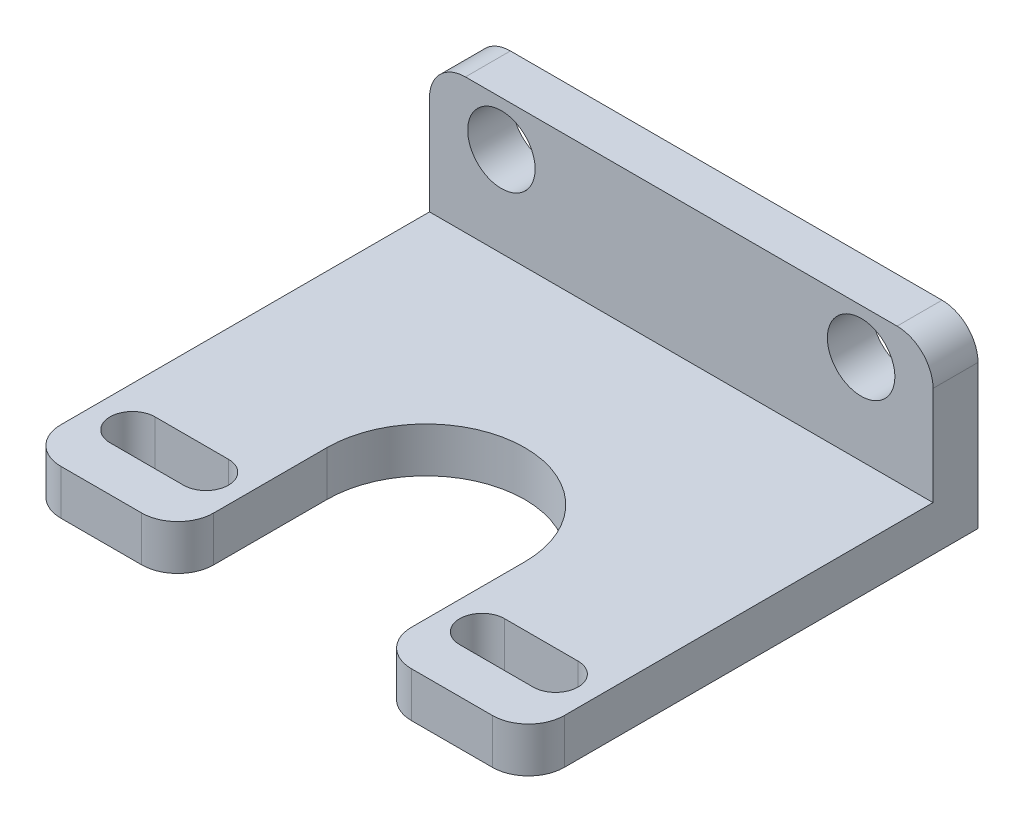
ISO-10303-21;
HEADER;
FILE_DESCRIPTION(('STEP AP214'),'2;1');
FILE_NAME('part.step','',(''),(''),'','','');
FILE_SCHEMA(('AUTOMOTIVE_DESIGN { 1 0 10303 214 1 1 1 1 }'));
ENDSEC;
DATA;
#1=APPLICATION_CONTEXT('core data for automotive mechanical design processes');
#2=APPLICATION_PROTOCOL_DEFINITION('international standard','automotive_design',2000,#1);
#3=PRODUCT_CONTEXT('',#1,'mechanical');
#4=PRODUCT('Part','Part','',(#3));
#5=PRODUCT_RELATED_PRODUCT_CATEGORY('part','',(#4));
#6=PRODUCT_DEFINITION_FORMATION('','',#4);
#7=PRODUCT_DEFINITION_CONTEXT('part definition',#1,'design');
#8=PRODUCT_DEFINITION('design','',#6,#7);
#9=PRODUCT_DEFINITION_SHAPE('','',#8);
#10=(LENGTH_UNIT() NAMED_UNIT(*) SI_UNIT(.MILLI.,.METRE.));
#11=(NAMED_UNIT(*) PLANE_ANGLE_UNIT() SI_UNIT($,.RADIAN.));
#12=(NAMED_UNIT(*) SI_UNIT($,.STERADIAN.) SOLID_ANGLE_UNIT());
#13=UNCERTAINTY_MEASURE_WITH_UNIT(LENGTH_MEASURE(1.E-05),#10,'distance_accuracy_value','');
#14=(GEOMETRIC_REPRESENTATION_CONTEXT(3) GLOBAL_UNCERTAINTY_ASSIGNED_CONTEXT((#13)) GLOBAL_UNIT_ASSIGNED_CONTEXT((#10,
#11,#12)) REPRESENTATION_CONTEXT('',''));
#15=CARTESIAN_POINT('',(0.,0.,0.));
#16=DIRECTION('',(0.,0.,1.));
#17=DIRECTION('',(1.,0.,0.));
#18=AXIS2_PLACEMENT_3D('',#15,#16,#17);
#19=CARTESIAN_POINT('',(0.,0.,31.75));
#20=DIRECTION('',(0.,0.,1.));
#21=DIRECTION('',(1.,0.,0.));
#22=AXIS2_PLACEMENT_3D('',#19,#20,#21);
#23=PLANE('',#22);
#24=DIRECTION('',(1.,0.,0.));
#25=VECTOR('',#24,1.);
#26=CARTESIAN_POINT('',(-17.78,-6.34999999999999,31.75));
#27=LINE('',#26,#25);
#28=CARTESIAN_POINT('',(-15.24,-6.34999999999999,31.75));
#29=VERTEX_POINT('',#28);
#30=CARTESIAN_POINT('',(-9.525,-6.34999999999999,31.75));
#31=VERTEX_POINT('',#30);
#32=EDGE_CURVE('E298',#29,#31,#27,.T.);
#33=ORIENTED_EDGE('',*,*,#32,.T.);
#34=DIRECTION('',(0.,-1.,0.));
#35=VECTOR('',#34,1.);
#36=CARTESIAN_POINT('',(-9.525,-3.17499999999999,31.75));
#37=LINE('',#36,#35);
#38=CARTESIAN_POINT('',(-9.525,-3.17499999999999,31.75));
#39=VERTEX_POINT('',#38);
#40=EDGE_CURVE('E359',#31,#39,#37,.F.);
#41=ORIENTED_EDGE('',*,*,#40,.T.);
#42=DIRECTION('',(-1.,0.,0.));
#43=VECTOR('',#42,1.);
#44=CARTESIAN_POINT('',(-17.78,-3.17499999999999,31.75));
#45=LINE('',#44,#43);
#46=CARTESIAN_POINT('',(-15.24,-3.17499999999999,31.75));
#47=VERTEX_POINT('',#46);
#48=EDGE_CURVE('E297',#39,#47,#45,.T.);
#49=ORIENTED_EDGE('',*,*,#48,.T.);
#50=DIRECTION('',(0.,-1.,0.));
#51=VECTOR('',#50,1.);
#52=CARTESIAN_POINT('',(-15.24,-6.34999999999999,31.75));
#53=LINE('',#52,#51);
#54=EDGE_CURVE('E356',#47,#29,#53,.T.);
#55=ORIENTED_EDGE('',*,*,#54,.T.);
#56=EDGE_LOOP('',(#33,#41,#49,#55));
#57=FACE_BOUND('',#56,.T.);
#58=ADVANCED_FACE('F41',(#57),#23,.T.);
#59=CARTESIAN_POINT('',(0.,0.,3.175));
#60=DIRECTION('',(0.,0.,1.));
#61=DIRECTION('',(1.,0.,0.));
#62=AXIS2_PLACEMENT_3D('',#59,#60,#61);
#63=PLANE('',#62);
#64=DIRECTION('',(-1.,0.,0.));
#65=VECTOR('',#64,1.);
#66=CARTESIAN_POINT('',(-17.78,6.35,3.175));
#67=LINE('',#66,#65);
#68=CARTESIAN_POINT('',(15.24,6.35000000000001,3.175));
#69=VERTEX_POINT('',#68);
#70=CARTESIAN_POINT('',(-15.24,6.35,3.175));
#71=VERTEX_POINT('',#70);
#72=EDGE_CURVE('E366',#69,#71,#67,.T.);
#73=ORIENTED_EDGE('',*,*,#72,.T.);
#74=CARTESIAN_POINT('',(-15.24,3.81,3.175));
#75=DIRECTION('',(0.,0.,1.));
#76=DIRECTION('',(1.,0.,0.));
#77=AXIS2_PLACEMENT_3D('',#74,#75,#76);
#78=CIRCLE('',#77,2.54);
#79=CARTESIAN_POINT('',(-17.78,3.81,3.175));
#80=VERTEX_POINT('',#79);
#81=EDGE_CURVE('E11',#71,#80,#78,.T.);
#82=ORIENTED_EDGE('',*,*,#81,.T.);
#83=DIRECTION('',(0.,-1.,0.));
#84=VECTOR('',#83,1.);
#85=CARTESIAN_POINT('',(-17.78,6.35,3.175));
#86=LINE('',#85,#84);
#87=CARTESIAN_POINT('',(-17.78,-3.17499999999999,3.175));
#88=VERTEX_POINT('',#87);
#89=EDGE_CURVE('E362',#80,#88,#86,.T.);
#90=ORIENTED_EDGE('',*,*,#89,.T.);
#91=DIRECTION('',(-1.,0.,0.));
#92=VECTOR('',#91,1.);
#93=CARTESIAN_POINT('',(-17.78,-3.17499999999999,3.175));
#94=LINE('',#93,#92);
#95=CARTESIAN_POINT('',(17.78,-3.17499999999999,3.175));
#96=VERTEX_POINT('',#95);
#97=EDGE_CURVE('E291',#96,#88,#94,.T.);
#98=ORIENTED_EDGE('',*,*,#97,.F.);
#99=DIRECTION('',(0.,1.,0.));
#100=VECTOR('',#99,1.);
#101=CARTESIAN_POINT('',(17.78,6.35000000000001,3.175));
#102=LINE('',#101,#100);
#103=CARTESIAN_POINT('',(17.78,3.81000000000001,3.175));
#104=VERTEX_POINT('',#103);
#105=EDGE_CURVE('E310',#96,#104,#102,.T.);
#106=ORIENTED_EDGE('',*,*,#105,.T.);
#107=CARTESIAN_POINT('',(15.24,3.81000000000001,3.175));
#108=DIRECTION('',(0.,0.,1.));
#109=DIRECTION('',(1.,0.,0.));
#110=AXIS2_PLACEMENT_3D('',#107,#108,#109);
#111=CIRCLE('',#110,2.54);
#112=EDGE_CURVE('E49',#104,#69,#111,.T.);
#113=ORIENTED_EDGE('',*,*,#112,.T.);
#114=EDGE_LOOP('',(#73,#82,#90,#98,#106,#113));
#115=FACE_BOUND('',#114,.T.);
#116=CARTESIAN_POINT('',(-12.7,3.175,3.175));
#117=DIRECTION('',(0.,0.,1.));
#118=DIRECTION('',(1.,0.,0.));
#119=AXIS2_PLACEMENT_3D('',#116,#117,#118);
#120=CIRCLE('',#119,2.38125);
#121=CARTESIAN_POINT('',(-10.31875,3.175,3.175));
#122=VERTEX_POINT('',#121);
#123=EDGE_CURVE('E375',#122,#122,#120,.T.);
#124=ORIENTED_EDGE('',*,*,#123,.F.);
#125=EDGE_LOOP('',(#124));
#126=FACE_BOUND('',#125,.T.);
#127=CARTESIAN_POINT('',(12.7,3.175,3.175));
#128=DIRECTION('',(0.,0.,1.));
#129=DIRECTION('',(-1.,0.,0.));
#130=AXIS2_PLACEMENT_3D('',#127,#128,#129);
#131=CIRCLE('',#130,2.38125);
#132=CARTESIAN_POINT('',(10.31875,3.175,3.175));
#133=VERTEX_POINT('',#132);
#134=EDGE_CURVE('E304',#133,#133,#131,.T.);
#135=ORIENTED_EDGE('',*,*,#134,.F.);
#136=EDGE_LOOP('',(#135));
#137=FACE_BOUND('',#136,.T.);
#138=ADVANCED_FACE('F477',(#115,#126,#137),#63,.T.);
#139=CARTESIAN_POINT('',(0.,0.,0.));
#140=DIRECTION('',(0.,0.,1.));
#141=DIRECTION('',(1.,0.,0.));
#142=AXIS2_PLACEMENT_3D('',#139,#140,#141);
#143=PLANE('',#142);
#144=DIRECTION('',(0.,-1.,0.));
#145=VECTOR('',#144,1.);
#146=CARTESIAN_POINT('',(-17.78,6.35,0.));
#147=LINE('',#146,#145);
#148=CARTESIAN_POINT('',(-17.78,3.81,0.));
#149=VERTEX_POINT('',#148);
#150=CARTESIAN_POINT('',(-17.78,-6.35,0.));
#151=VERTEX_POINT('',#150);
#152=EDGE_CURVE('E377',#149,#151,#147,.T.);
#153=ORIENTED_EDGE('',*,*,#152,.F.);
#154=CARTESIAN_POINT('',(-15.24,3.81,0.));
#155=DIRECTION('',(0.,0.,1.));
#156=DIRECTION('',(1.,0.,0.));
#157=AXIS2_PLACEMENT_3D('',#154,#155,#156);
#158=CIRCLE('',#157,2.54);
#159=CARTESIAN_POINT('',(-15.24,6.35,0.));
#160=VERTEX_POINT('',#159);
#161=EDGE_CURVE('E720',#149,#160,#158,.F.);
#162=ORIENTED_EDGE('',*,*,#161,.T.);
#163=DIRECTION('',(-1.,0.,0.));
#164=VECTOR('',#163,1.);
#165=CARTESIAN_POINT('',(-17.78,6.35,0.));
#166=LINE('',#165,#164);
#167=CARTESIAN_POINT('',(15.24,6.35000000000001,0.));
#168=VERTEX_POINT('',#167);
#169=EDGE_CURVE('E374',#168,#160,#166,.T.);
#170=ORIENTED_EDGE('',*,*,#169,.F.);
#171=CARTESIAN_POINT('',(15.24,3.81000000000001,0.));
#172=DIRECTION('',(0.,0.,1.));
#173=DIRECTION('',(1.,0.,0.));
#174=AXIS2_PLACEMENT_3D('',#171,#172,#173);
#175=CIRCLE('',#174,2.54);
#176=CARTESIAN_POINT('',(17.78,3.81000000000001,0.));
#177=VERTEX_POINT('',#176);
#178=EDGE_CURVE('E722',#168,#177,#175,.F.);
#179=ORIENTED_EDGE('',*,*,#178,.T.);
#180=DIRECTION('',(0.,1.,0.));
#181=VECTOR('',#180,1.);
#182=CARTESIAN_POINT('',(17.78,6.35000000000001,0.));
#183=LINE('',#182,#181);
#184=CARTESIAN_POINT('',(17.78,-6.34999999999999,0.));
#185=VERTEX_POINT('',#184);
#186=EDGE_CURVE('E371',#185,#177,#183,.T.);
#187=ORIENTED_EDGE('',*,*,#186,.F.);
#188=DIRECTION('',(1.,0.,0.));
#189=VECTOR('',#188,1.);
#190=CARTESIAN_POINT('',(-17.78,-6.35,0.));
#191=LINE('',#190,#189);
#192=EDGE_CURVE('E379',#151,#185,#191,.T.);
#193=ORIENTED_EDGE('',*,*,#192,.F.);
#194=EDGE_LOOP('',(#153,#162,#170,#179,#187,#193));
#195=FACE_BOUND('',#194,.T.);
#196=CARTESIAN_POINT('',(-12.7,3.175,0.));
#197=DIRECTION('',(0.,0.,1.));
#198=DIRECTION('',(1.,0.,0.));
#199=AXIS2_PLACEMENT_3D('',#196,#197,#198);
#200=CIRCLE('',#199,2.38125);
#201=CARTESIAN_POINT('',(-10.31875,3.175,0.));
#202=VERTEX_POINT('',#201);
#203=EDGE_CURVE('E452',#202,#202,#200,.T.);
#204=ORIENTED_EDGE('',*,*,#203,.T.);
#205=EDGE_LOOP('',(#204));
#206=FACE_BOUND('',#205,.T.);
#207=CARTESIAN_POINT('',(12.7,3.175,0.));
#208=DIRECTION('',(0.,0.,1.));
#209=DIRECTION('',(-1.,0.,0.));
#210=AXIS2_PLACEMENT_3D('',#207,#208,#209);
#211=CIRCLE('',#210,2.38125);
#212=CARTESIAN_POINT('',(10.31875,3.175,0.));
#213=VERTEX_POINT('',#212);
#214=EDGE_CURVE('E447',#213,#213,#211,.T.);
#215=ORIENTED_EDGE('',*,*,#214,.T.);
#216=EDGE_LOOP('',(#215));
#217=FACE_BOUND('',#216,.T.);
#218=ADVANCED_FACE('F460',(#195,#206,#217),#143,.F.);
#219=CARTESIAN_POINT('',(17.78,6.35000000000001,3.175));
#220=DIRECTION('',(-1.,0.,0.));
#221=DIRECTION('',(0.,-1.,0.));
#222=AXIS2_PLACEMENT_3D('',#219,#220,#221);
#223=PLANE('',#222);
#224=DIRECTION('',(0.,0.,-1.));
#225=VECTOR('',#224,1.);
#226=CARTESIAN_POINT('',(17.78,-3.17499999999999,31.75));
#227=LINE('',#226,#225);
#228=CARTESIAN_POINT('',(17.78,-3.17499999999999,29.21));
#229=VERTEX_POINT('',#228);
#230=EDGE_CURVE('E321',#229,#96,#227,.T.);
#231=ORIENTED_EDGE('',*,*,#230,.F.);
#232=DIRECTION('',(0.,1.,0.));
#233=VECTOR('',#232,1.);
#234=CARTESIAN_POINT('',(17.78,-6.34999999999999,29.21));
#235=LINE('',#234,#233);
#236=CARTESIAN_POINT('',(17.78,-6.34999999999999,29.21));
#237=VERTEX_POINT('',#236);
#238=EDGE_CURVE('E351',#229,#237,#235,.F.);
#239=ORIENTED_EDGE('',*,*,#238,.T.);
#240=DIRECTION('',(0.,0.,-1.));
#241=VECTOR('',#240,1.);
#242=CARTESIAN_POINT('',(17.78,-6.34999999999999,3.175));
#243=LINE('',#242,#241);
#244=EDGE_CURVE('E365',#237,#185,#243,.T.);
#245=ORIENTED_EDGE('',*,*,#244,.T.);
#246=ORIENTED_EDGE('',*,*,#186,.T.);
#247=DIRECTION('',(0.,0.,-1.));
#248=VECTOR('',#247,1.);
#249=CARTESIAN_POINT('',(17.78,3.81000000000001,3.175));
#250=LINE('',#249,#248);
#251=EDGE_CURVE('E349',#177,#104,#250,.F.);
#252=ORIENTED_EDGE('',*,*,#251,.T.);
#253=ORIENTED_EDGE('',*,*,#105,.F.);
#254=EDGE_LOOP('',(#231,#239,#245,#246,#252,#253));
#255=FACE_BOUND('',#254,.T.);
#256=ADVANCED_FACE('F446',(#255),#223,.F.);
#257=CARTESIAN_POINT('',(-17.78,6.35,3.175));
#258=DIRECTION('',(0.,-1.,0.));
#259=DIRECTION('',(1.,0.,0.));
#260=AXIS2_PLACEMENT_3D('',#257,#258,#259);
#261=PLANE('',#260);
#262=ORIENTED_EDGE('',*,*,#169,.T.);
#263=DIRECTION('',(0.,0.,-1.));
#264=VECTOR('',#263,1.);
#265=CARTESIAN_POINT('',(-15.24,6.35,3.175));
#266=LINE('',#265,#264);
#267=EDGE_CURVE('E56',#160,#71,#266,.F.);
#268=ORIENTED_EDGE('',*,*,#267,.T.);
#269=ORIENTED_EDGE('',*,*,#72,.F.);
#270=DIRECTION('',(0.,0.,-1.));
#271=VECTOR('',#270,1.);
#272=CARTESIAN_POINT('',(15.24,6.35000000000001,3.175));
#273=LINE('',#272,#271);
#274=EDGE_CURVE('E716',#69,#168,#273,.T.);
#275=ORIENTED_EDGE('',*,*,#274,.T.);
#276=EDGE_LOOP('',(#262,#268,#269,#275));
#277=FACE_BOUND('',#276,.T.);
#278=ADVANCED_FACE('F620',(#277),#261,.F.);
#279=CARTESIAN_POINT('',(-17.78,6.35,3.175));
#280=DIRECTION('',(1.,0.,0.));
#281=DIRECTION('',(0.,1.,0.));
#282=AXIS2_PLACEMENT_3D('',#279,#280,#281);
#283=PLANE('',#282);
#284=DIRECTION('',(0.,0.,-1.));
#285=VECTOR('',#284,1.);
#286=CARTESIAN_POINT('',(-17.78,-6.35,3.175));
#287=LINE('',#286,#285);
#288=CARTESIAN_POINT('',(-17.78,-6.35,29.21));
#289=VERTEX_POINT('',#288);
#290=EDGE_CURVE('E382',#289,#151,#287,.T.);
#291=ORIENTED_EDGE('',*,*,#290,.F.);
#292=DIRECTION('',(0.,-1.,0.));
#293=VECTOR('',#292,1.);
#294=CARTESIAN_POINT('',(-17.78,-3.17499999999999,29.21));
#295=LINE('',#294,#293);
#296=CARTESIAN_POINT('',(-17.78,-3.17499999999999,29.21));
#297=VERTEX_POINT('',#296);
#298=EDGE_CURVE('E711',#289,#297,#295,.F.);
#299=ORIENTED_EDGE('',*,*,#298,.T.);
#300=DIRECTION('',(0.,0.,-1.));
#301=VECTOR('',#300,1.);
#302=CARTESIAN_POINT('',(-17.78,-3.17499999999999,31.75));
#303=LINE('',#302,#301);
#304=EDGE_CURVE('E301',#297,#88,#303,.T.);
#305=ORIENTED_EDGE('',*,*,#304,.T.);
#306=ORIENTED_EDGE('',*,*,#89,.F.);
#307=DIRECTION('',(0.,0.,-1.));
#308=VECTOR('',#307,1.);
#309=CARTESIAN_POINT('',(-17.78,3.81,3.175));
#310=LINE('',#309,#308);
#311=EDGE_CURVE('E361',#80,#149,#310,.T.);
#312=ORIENTED_EDGE('',*,*,#311,.T.);
#313=ORIENTED_EDGE('',*,*,#152,.T.);
#314=EDGE_LOOP('',(#291,#299,#305,#306,#312,#313));
#315=FACE_BOUND('',#314,.T.);
#316=ADVANCED_FACE('F473',(#315),#283,.F.);
#317=CARTESIAN_POINT('',(-17.78,-6.35,3.175));
#318=DIRECTION('',(0.,1.,0.));
#319=DIRECTION('',(-1.,0.,0.));
#320=AXIS2_PLACEMENT_3D('',#317,#318,#319);
#321=PLANE('',#320);
#322=DIRECTION('',(-1.,0.,0.));
#323=VECTOR('',#322,1.);
#324=CARTESIAN_POINT('',(14.9387818248776,-6.34999999999999,28.575));
#325=LINE('',#324,#323);
#326=CARTESIAN_POINT('',(14.9387818248776,-6.34999999999999,28.575));
#327=VERTEX_POINT('',#326);
#328=CARTESIAN_POINT('',(9.75066886203051,-6.34999999999999,28.575));
#329=VERTEX_POINT('',#328);
#330=EDGE_CURVE('E226',#327,#329,#325,.T.);
#331=ORIENTED_EDGE('',*,*,#330,.F.);
#332=CARTESIAN_POINT('',(14.9387818248776,-6.34999999999999,26.9875));
#333=DIRECTION('',(0.,-1.,0.));
#334=DIRECTION('',(-1.,0.,0.));
#335=AXIS2_PLACEMENT_3D('',#332,#333,#334);
#336=CIRCLE('',#335,1.5875);
#337=CARTESIAN_POINT('',(14.9387818248776,-6.34999999999999,25.4));
#338=VERTEX_POINT('',#337);
#339=EDGE_CURVE('E231',#338,#327,#336,.T.);
#340=ORIENTED_EDGE('',*,*,#339,.F.);
#341=DIRECTION('',(1.,0.,0.));
#342=VECTOR('',#341,1.);
#343=CARTESIAN_POINT('',(14.9387818248776,-6.34999999999999,25.4));
#344=LINE('',#343,#342);
#345=CARTESIAN_POINT('',(9.75066886203051,-6.34999999999999,25.4));
#346=VERTEX_POINT('',#345);
#347=EDGE_CURVE('E236',#346,#338,#344,.T.);
#348=ORIENTED_EDGE('',*,*,#347,.F.);
#349=CARTESIAN_POINT('',(9.75066886203051,-6.34999999999999,26.9875));
#350=DIRECTION('',(0.,-1.,0.));
#351=DIRECTION('',(-1.,0.,0.));
#352=AXIS2_PLACEMENT_3D('',#349,#350,#351);
#353=CIRCLE('',#352,1.5875);
#354=EDGE_CURVE('E215',#329,#346,#353,.T.);
#355=ORIENTED_EDGE('',*,*,#354,.F.);
#356=EDGE_LOOP('',(#331,#340,#348,#355));
#357=FACE_BOUND('',#356,.T.);
#358=DIRECTION('',(1.,0.,0.));
#359=VECTOR('',#358,1.);
#360=CARTESIAN_POINT('',(-14.9387818248776,-6.35,25.4));
#361=LINE('',#360,#359);
#362=CARTESIAN_POINT('',(-14.9387818248776,-6.35,25.4));
#363=VERTEX_POINT('',#362);
#364=CARTESIAN_POINT('',(-9.75066886203051,-6.35,25.4));
#365=VERTEX_POINT('',#364);
#366=EDGE_CURVE('E253',#363,#365,#361,.T.);
#367=ORIENTED_EDGE('',*,*,#366,.F.);
#368=CARTESIAN_POINT('',(-14.9387818248776,-6.35,26.9875));
#369=DIRECTION('',(0.,-1.,0.));
#370=DIRECTION('',(1.,0.,0.));
#371=AXIS2_PLACEMENT_3D('',#368,#369,#370);
#372=CIRCLE('',#371,1.5875);
#373=CARTESIAN_POINT('',(-14.9387818248776,-6.35,28.575));
#374=VERTEX_POINT('',#373);
#375=EDGE_CURVE('E248',#374,#363,#372,.T.);
#376=ORIENTED_EDGE('',*,*,#375,.F.);
#377=DIRECTION('',(-1.,0.,0.));
#378=VECTOR('',#377,1.);
#379=CARTESIAN_POINT('',(-14.9387818248776,-6.35,28.575));
#380=LINE('',#379,#378);
#381=CARTESIAN_POINT('',(-9.75066886203051,-6.35,28.575));
#382=VERTEX_POINT('',#381);
#383=EDGE_CURVE('E259',#382,#374,#380,.T.);
#384=ORIENTED_EDGE('',*,*,#383,.F.);
#385=CARTESIAN_POINT('',(-9.75066886203051,-6.35,26.9875));
#386=DIRECTION('',(0.,-1.,0.));
#387=DIRECTION('',(1.,0.,0.));
#388=AXIS2_PLACEMENT_3D('',#385,#386,#387);
#389=CIRCLE('',#388,1.5875);
#390=EDGE_CURVE('E256',#365,#382,#389,.T.);
#391=ORIENTED_EDGE('',*,*,#390,.F.);
#392=EDGE_LOOP('',(#367,#376,#384,#391));
#393=FACE_BOUND('',#392,.T.);
#394=CARTESIAN_POINT('',(9.525,-6.34999999999999,31.75));
#395=VERTEX_POINT('',#394);
#396=CARTESIAN_POINT('',(15.24,-6.34999999999999,31.75));
#397=VERTEX_POINT('',#396);
#398=EDGE_CURVE('E296',#395,#397,#27,.T.);
#399=ORIENTED_EDGE('',*,*,#398,.F.);
#400=CARTESIAN_POINT('',(9.525,-6.34999999999999,29.21));
#401=DIRECTION('',(0.,1.,0.));
#402=DIRECTION('',(-1.,0.,0.));
#403=AXIS2_PLACEMENT_3D('',#400,#401,#402);
#404=CIRCLE('',#403,2.54);
#405=CARTESIAN_POINT('',(6.985,-6.34999999999999,29.21));
#406=VERTEX_POINT('',#405);
#407=EDGE_CURVE('E346',#395,#406,#404,.F.);
#408=ORIENTED_EDGE('',*,*,#407,.T.);
#409=DIRECTION('',(0.,0.,1.));
#410=VECTOR('',#409,1.);
#411=CARTESIAN_POINT('',(6.985,-6.34999999999999,42.291890453825));
#412=LINE('',#411,#410);
#413=CARTESIAN_POINT('',(6.985,-6.34999999999999,21.208109546175));
#414=VERTEX_POINT('',#413);
#415=EDGE_CURVE('E274',#414,#406,#412,.T.);
#416=ORIENTED_EDGE('',*,*,#415,.F.);
#417=CARTESIAN_POINT('',(0.,-6.34999999999999,21.208109546175));
#418=DIRECTION('',(0.,-1.,0.));
#419=DIRECTION('',(1.,0.,0.));
#420=AXIS2_PLACEMENT_3D('',#417,#418,#419);
#421=CIRCLE('',#420,6.985);
#422=CARTESIAN_POINT('',(-6.985,-6.34999999999999,21.208109546175));
#423=VERTEX_POINT('',#422);
#424=EDGE_CURVE('E265',#423,#414,#421,.T.);
#425=ORIENTED_EDGE('',*,*,#424,.F.);
#426=DIRECTION('',(0.,0.,-1.));
#427=VECTOR('',#426,1.);
#428=CARTESIAN_POINT('',(-6.985,-6.34999999999999,42.291890453825));
#429=LINE('',#428,#427);
#430=CARTESIAN_POINT('',(-6.985,-6.34999999999999,29.21));
#431=VERTEX_POINT('',#430);
#432=EDGE_CURVE('E278',#431,#423,#429,.T.);
#433=ORIENTED_EDGE('',*,*,#432,.F.);
#434=CARTESIAN_POINT('',(-9.525,-6.34999999999999,29.21));
#435=DIRECTION('',(0.,1.,0.));
#436=DIRECTION('',(-1.,0.,0.));
#437=AXIS2_PLACEMENT_3D('',#434,#435,#436);
#438=CIRCLE('',#437,2.54);
#439=EDGE_CURVE('E342',#431,#31,#438,.F.);
#440=ORIENTED_EDGE('',*,*,#439,.T.);
#441=ORIENTED_EDGE('',*,*,#32,.F.);
#442=CARTESIAN_POINT('',(-15.24,-6.35,29.21));
#443=DIRECTION('',(0.,1.,0.));
#444=DIRECTION('',(-1.,0.,0.));
#445=AXIS2_PLACEMENT_3D('',#442,#443,#444);
#446=CIRCLE('',#445,2.54);
#447=EDGE_CURVE('E340',#29,#289,#446,.F.);
#448=ORIENTED_EDGE('',*,*,#447,.T.);
#449=ORIENTED_EDGE('',*,*,#290,.T.);
#450=ORIENTED_EDGE('',*,*,#192,.T.);
#451=ORIENTED_EDGE('',*,*,#244,.F.);
#452=CARTESIAN_POINT('',(15.24,-6.34999999999999,29.21));
#453=DIRECTION('',(0.,1.,0.));
#454=DIRECTION('',(-1.,0.,0.));
#455=AXIS2_PLACEMENT_3D('',#452,#453,#454);
#456=CIRCLE('',#455,2.54);
#457=EDGE_CURVE('E344',#237,#397,#456,.F.);
#458=ORIENTED_EDGE('',*,*,#457,.T.);
#459=EDGE_LOOP('',(#399,#408,#416,#425,#433,#440,#441,#448,#449,#450,#451,#458));
#460=FACE_BOUND('',#459,.T.);
#461=ADVANCED_FACE('F233',(#357,#393,#460),#321,.F.);
#462=CARTESIAN_POINT('',(-12.7,3.175,3.175));
#463=DIRECTION('',(0.,0.,-1.));
#464=DIRECTION('',(-1.,0.,0.));
#465=AXIS2_PLACEMENT_3D('',#462,#463,#464);
#466=CYLINDRICAL_SURFACE('',#465,2.38125);
#467=ORIENTED_EDGE('',*,*,#123,.T.);
#468=EDGE_LOOP('',(#467));
#469=FACE_BOUND('',#468,.T.);
#470=ORIENTED_EDGE('',*,*,#203,.F.);
#471=EDGE_LOOP('',(#470));
#472=FACE_BOUND('',#471,.T.);
#473=ADVANCED_FACE('F462',(#469,#472),#466,.F.);
#474=CARTESIAN_POINT('',(12.7,3.175,3.175));
#475=DIRECTION('',(0.,0.,-1.));
#476=DIRECTION('',(-1.,0.,0.));
#477=AXIS2_PLACEMENT_3D('',#474,#475,#476);
#478=CYLINDRICAL_SURFACE('',#477,2.38125);
#479=ORIENTED_EDGE('',*,*,#134,.T.);
#480=EDGE_LOOP('',(#479));
#481=FACE_BOUND('',#480,.T.);
#482=ORIENTED_EDGE('',*,*,#214,.F.);
#483=EDGE_LOOP('',(#482));
#484=FACE_BOUND('',#483,.T.);
#485=ADVANCED_FACE('F464',(#481,#484),#478,.F.);
#486=CARTESIAN_POINT('',(-17.78,-3.17499999999999,31.75));
#487=DIRECTION('',(0.,-1.,0.));
#488=DIRECTION('',(0.,0.,-1.));
#489=AXIS2_PLACEMENT_3D('',#486,#487,#488);
#490=PLANE('',#489);
#491=DIRECTION('',(1.,0.,0.));
#492=VECTOR('',#491,1.);
#493=CARTESIAN_POINT('',(-17.78,-3.17499999999999,25.4));
#494=LINE('',#493,#492);
#495=CARTESIAN_POINT('',(9.75066886203051,-3.17499999999999,25.4));
#496=VERTEX_POINT('',#495);
#497=CARTESIAN_POINT('',(14.9387818248776,-3.17499999999999,25.4));
#498=VERTEX_POINT('',#497);
#499=EDGE_CURVE('E410',#496,#498,#494,.T.);
#500=ORIENTED_EDGE('',*,*,#499,.T.);
#501=CARTESIAN_POINT('',(14.9387818248776,-3.17499999999999,26.9875));
#502=DIRECTION('',(0.,-1.,0.));
#503=DIRECTION('',(0.,0.,-1.));
#504=AXIS2_PLACEMENT_3D('',#501,#502,#503);
#505=CIRCLE('',#504,1.5875);
#506=CARTESIAN_POINT('',(14.9387818248776,-3.17499999999999,28.575));
#507=VERTEX_POINT('',#506);
#508=EDGE_CURVE('E414',#498,#507,#505,.T.);
#509=ORIENTED_EDGE('',*,*,#508,.T.);
#510=DIRECTION('',(-1.,0.,0.));
#511=VECTOR('',#510,1.);
#512=CARTESIAN_POINT('',(-17.78,-3.17499999999999,28.575));
#513=LINE('',#512,#511);
#514=CARTESIAN_POINT('',(9.75066886203051,-3.17499999999999,28.575));
#515=VERTEX_POINT('',#514);
#516=EDGE_CURVE('E406',#507,#515,#513,.T.);
#517=ORIENTED_EDGE('',*,*,#516,.T.);
#518=CARTESIAN_POINT('',(9.75066886203051,-3.17499999999999,26.9875));
#519=DIRECTION('',(0.,-1.,0.));
#520=DIRECTION('',(0.,0.,-1.));
#521=AXIS2_PLACEMENT_3D('',#518,#519,#520);
#522=CIRCLE('',#521,1.5875);
#523=EDGE_CURVE('E218',#515,#496,#522,.T.);
#524=ORIENTED_EDGE('',*,*,#523,.T.);
#525=EDGE_LOOP('',(#500,#509,#517,#524));
#526=FACE_BOUND('',#525,.T.);
#527=DIRECTION('',(-1.,0.,0.));
#528=VECTOR('',#527,1.);
#529=CARTESIAN_POINT('',(-17.78,-3.17499999999999,28.575));
#530=LINE('',#529,#528);
#531=CARTESIAN_POINT('',(-9.75066886203051,-3.17499999999999,28.575));
#532=VERTEX_POINT('',#531);
#533=CARTESIAN_POINT('',(-14.9387818248776,-3.17499999999999,28.575));
#534=VERTEX_POINT('',#533);
#535=EDGE_CURVE('E400',#532,#534,#530,.T.);
#536=ORIENTED_EDGE('',*,*,#535,.T.);
#537=CARTESIAN_POINT('',(-14.9387818248776,-3.17499999999999,26.9875));
#538=DIRECTION('',(0.,-1.,0.));
#539=DIRECTION('',(0.,0.,-1.));
#540=AXIS2_PLACEMENT_3D('',#537,#538,#539);
#541=CIRCLE('',#540,1.5875);
#542=CARTESIAN_POINT('',(-14.9387818248776,-3.17499999999999,25.4));
#543=VERTEX_POINT('',#542);
#544=EDGE_CURVE('E403',#534,#543,#541,.T.);
#545=ORIENTED_EDGE('',*,*,#544,.T.);
#546=DIRECTION('',(1.,0.,0.));
#547=VECTOR('',#546,1.);
#548=CARTESIAN_POINT('',(-17.78,-3.17499999999999,25.4));
#549=LINE('',#548,#547);
#550=CARTESIAN_POINT('',(-9.75066886203051,-3.17499999999999,25.4));
#551=VERTEX_POINT('',#550);
#552=EDGE_CURVE('E390',#543,#551,#549,.T.);
#553=ORIENTED_EDGE('',*,*,#552,.T.);
#554=CARTESIAN_POINT('',(-9.75066886203051,-3.17499999999999,26.9875));
#555=DIRECTION('',(0.,-1.,0.));
#556=DIRECTION('',(0.,0.,-1.));
#557=AXIS2_PLACEMENT_3D('',#554,#555,#556);
#558=CIRCLE('',#557,1.5875);
#559=EDGE_CURVE('E395',#551,#532,#558,.T.);
#560=ORIENTED_EDGE('',*,*,#559,.T.);
#561=EDGE_LOOP('',(#536,#545,#553,#560));
#562=FACE_BOUND('',#561,.T.);
#563=DIRECTION('',(0.,0.,1.));
#564=VECTOR('',#563,1.);
#565=CARTESIAN_POINT('',(6.985,-3.17499999999999,31.75));
#566=LINE('',#565,#564);
#567=CARTESIAN_POINT('',(6.985,-3.17499999999999,21.208109546175));
#568=VERTEX_POINT('',#567);
#569=CARTESIAN_POINT('',(6.985,-3.17499999999999,29.21));
#570=VERTEX_POINT('',#569);
#571=EDGE_CURVE('E284',#568,#570,#566,.T.);
#572=ORIENTED_EDGE('',*,*,#571,.T.);
#573=CARTESIAN_POINT('',(9.525,-3.17499999999999,29.21));
#574=DIRECTION('',(0.,-1.,0.));
#575=DIRECTION('',(0.,0.,-1.));
#576=AXIS2_PLACEMENT_3D('',#573,#574,#575);
#577=CIRCLE('',#576,2.54);
#578=CARTESIAN_POINT('',(9.525,-3.17499999999999,31.75));
#579=VERTEX_POINT('',#578);
#580=EDGE_CURVE('E331',#570,#579,#577,.F.);
#581=ORIENTED_EDGE('',*,*,#580,.T.);
#582=CARTESIAN_POINT('',(15.24,-3.17499999999999,31.75));
#583=VERTEX_POINT('',#582);
#584=EDGE_CURVE('E292',#583,#579,#45,.T.);
#585=ORIENTED_EDGE('',*,*,#584,.F.);
#586=CARTESIAN_POINT('',(15.24,-3.17499999999999,29.21));
#587=DIRECTION('',(0.,-1.,0.));
#588=DIRECTION('',(0.,0.,-1.));
#589=AXIS2_PLACEMENT_3D('',#586,#587,#588);
#590=CIRCLE('',#589,2.54);
#591=EDGE_CURVE('E328',#583,#229,#590,.F.);
#592=ORIENTED_EDGE('',*,*,#591,.T.);
#593=ORIENTED_EDGE('',*,*,#230,.T.);
#594=ORIENTED_EDGE('',*,*,#97,.T.);
#595=ORIENTED_EDGE('',*,*,#304,.F.);
#596=CARTESIAN_POINT('',(-15.24,-3.17499999999999,29.21));
#597=DIRECTION('',(0.,-1.,0.));
#598=DIRECTION('',(0.,0.,-1.));
#599=AXIS2_PLACEMENT_3D('',#596,#597,#598);
#600=CIRCLE('',#599,2.54);
#601=EDGE_CURVE('E323',#297,#47,#600,.F.);
#602=ORIENTED_EDGE('',*,*,#601,.T.);
#603=ORIENTED_EDGE('',*,*,#48,.F.);
#604=CARTESIAN_POINT('',(-9.525,-3.17499999999999,29.21));
#605=DIRECTION('',(0.,-1.,0.));
#606=DIRECTION('',(0.,0.,-1.));
#607=AXIS2_PLACEMENT_3D('',#604,#605,#606);
#608=CIRCLE('',#607,2.54);
#609=CARTESIAN_POINT('',(-6.985,-3.17499999999999,29.21));
#610=VERTEX_POINT('',#609);
#611=EDGE_CURVE('E325',#39,#610,#608,.F.);
#612=ORIENTED_EDGE('',*,*,#611,.T.);
#613=DIRECTION('',(0.,0.,-1.));
#614=VECTOR('',#613,1.);
#615=CARTESIAN_POINT('',(-6.985,-3.17499999999999,31.75));
#616=LINE('',#615,#614);
#617=CARTESIAN_POINT('',(-6.985,-3.17499999999999,21.208109546175));
#618=VERTEX_POINT('',#617);
#619=EDGE_CURVE('E289',#610,#618,#616,.T.);
#620=ORIENTED_EDGE('',*,*,#619,.T.);
#621=CARTESIAN_POINT('',(0.,-3.17499999999999,21.208109546175));
#622=DIRECTION('',(0.,-1.,0.));
#623=DIRECTION('',(0.,0.,-1.));
#624=AXIS2_PLACEMENT_3D('',#621,#622,#623);
#625=CIRCLE('',#624,6.985);
#626=EDGE_CURVE('E384',#618,#568,#625,.T.);
#627=ORIENTED_EDGE('',*,*,#626,.T.);
#628=EDGE_LOOP('',(#572,#581,#585,#592,#593,#594,#595,#602,#603,#612,#620,#627));
#629=FACE_BOUND('',#628,.T.);
#630=ADVANCED_FACE('F426',(#526,#562,#629),#490,.F.);
#631=ORIENTED_EDGE('',*,*,#584,.T.);
#632=DIRECTION('',(0.,1.,0.));
#633=VECTOR('',#632,1.);
#634=CARTESIAN_POINT('',(9.525,-6.34999999999999,31.75));
#635=LINE('',#634,#633);
#636=EDGE_CURVE('E337',#579,#395,#635,.F.);
#637=ORIENTED_EDGE('',*,*,#636,.T.);
#638=ORIENTED_EDGE('',*,*,#398,.T.);
#639=DIRECTION('',(0.,1.,0.));
#640=VECTOR('',#639,1.);
#641=CARTESIAN_POINT('',(15.24,-3.17499999999999,31.75));
#642=LINE('',#641,#640);
#643=EDGE_CURVE('E334',#397,#583,#642,.T.);
#644=ORIENTED_EDGE('',*,*,#643,.T.);
#645=EDGE_LOOP('',(#631,#637,#638,#644));
#646=FACE_BOUND('',#645,.T.);
#647=ADVANCED_FACE('F430',(#646),#23,.T.);
#648=CARTESIAN_POINT('',(0.,22.225,21.208109546175));
#649=DIRECTION('',(0.,-1.,0.));
#650=DIRECTION('',(1.,0.,0.));
#651=AXIS2_PLACEMENT_3D('',#648,#649,#650);
#652=CYLINDRICAL_SURFACE('',#651,6.985);
#653=DIRECTION('',(0.,-1.,0.));
#654=VECTOR('',#653,1.);
#655=CARTESIAN_POINT('',(-6.985,22.225,21.208109546175));
#656=LINE('',#655,#654);
#657=EDGE_CURVE('E281',#618,#423,#656,.T.);
#658=ORIENTED_EDGE('',*,*,#657,.T.);
#659=ORIENTED_EDGE('',*,*,#424,.T.);
#660=DIRECTION('',(0.,-1.,0.));
#661=VECTOR('',#660,1.);
#662=CARTESIAN_POINT('',(6.985,22.225,21.208109546175));
#663=LINE('',#662,#661);
#664=EDGE_CURVE('E280',#568,#414,#663,.T.);
#665=ORIENTED_EDGE('',*,*,#664,.F.);
#666=ORIENTED_EDGE('',*,*,#626,.F.);
#667=EDGE_LOOP('',(#658,#659,#665,#666));
#668=FACE_BOUND('',#667,.T.);
#669=ADVANCED_FACE('F486',(#668),#652,.F.);
#670=CARTESIAN_POINT('',(-6.985,22.225,42.291890453825));
#671=DIRECTION('',(-1.,0.,0.));
#672=DIRECTION('',(0.,0.,1.));
#673=AXIS2_PLACEMENT_3D('',#670,#671,#672);
#674=PLANE('',#673);
#675=ORIENTED_EDGE('',*,*,#619,.F.);
#676=DIRECTION('',(0.,-1.,0.));
#677=VECTOR('',#676,1.);
#678=CARTESIAN_POINT('',(-6.985,-6.34999999999999,29.21));
#679=LINE('',#678,#677);
#680=EDGE_CURVE('E353',#610,#431,#679,.T.);
#681=ORIENTED_EDGE('',*,*,#680,.T.);
#682=ORIENTED_EDGE('',*,*,#432,.T.);
#683=ORIENTED_EDGE('',*,*,#657,.F.);
#684=EDGE_LOOP('',(#675,#681,#682,#683));
#685=FACE_BOUND('',#684,.T.);
#686=ADVANCED_FACE('F491',(#685),#674,.F.);
#687=CARTESIAN_POINT('',(6.985,22.225,42.291890453825));
#688=DIRECTION('',(1.,0.,0.));
#689=DIRECTION('',(0.,1.,0.));
#690=AXIS2_PLACEMENT_3D('',#687,#688,#689);
#691=PLANE('',#690);
#692=ORIENTED_EDGE('',*,*,#415,.T.);
#693=DIRECTION('',(0.,1.,0.));
#694=VECTOR('',#693,1.);
#695=CARTESIAN_POINT('',(6.985,-3.17499999999999,29.21));
#696=LINE('',#695,#694);
#697=EDGE_CURVE('E326',#406,#570,#696,.T.);
#698=ORIENTED_EDGE('',*,*,#697,.T.);
#699=ORIENTED_EDGE('',*,*,#571,.F.);
#700=ORIENTED_EDGE('',*,*,#664,.T.);
#701=EDGE_LOOP('',(#692,#698,#699,#700));
#702=FACE_BOUND('',#701,.T.);
#703=ADVANCED_FACE('F421',(#702),#691,.F.);
#704=CARTESIAN_POINT('',(-14.9387818248776,22.225,26.9875));
#705=DIRECTION('',(0.,-1.,0.));
#706=DIRECTION('',(1.,0.,0.));
#707=AXIS2_PLACEMENT_3D('',#704,#705,#706);
#708=CYLINDRICAL_SURFACE('',#707,1.5875);
#709=DIRECTION('',(0.,-1.,0.));
#710=VECTOR('',#709,1.);
#711=CARTESIAN_POINT('',(-14.9387818248776,22.225,28.575));
#712=LINE('',#711,#710);
#713=EDGE_CURVE('E263',#534,#374,#712,.T.);
#714=ORIENTED_EDGE('',*,*,#713,.T.);
#715=ORIENTED_EDGE('',*,*,#375,.T.);
#716=DIRECTION('',(0.,-1.,0.));
#717=VECTOR('',#716,1.);
#718=CARTESIAN_POINT('',(-14.9387818248776,22.225,25.4));
#719=LINE('',#718,#717);
#720=EDGE_CURVE('E262',#543,#363,#719,.T.);
#721=ORIENTED_EDGE('',*,*,#720,.F.);
#722=ORIENTED_EDGE('',*,*,#544,.F.);
#723=EDGE_LOOP('',(#714,#715,#721,#722));
#724=FACE_BOUND('',#723,.T.);
#725=ADVANCED_FACE('F510',(#724),#708,.F.);
#726=CARTESIAN_POINT('',(-14.9387818248776,22.225,28.575));
#727=DIRECTION('',(0.,0.,1.));
#728=DIRECTION('',(1.,0.,0.));
#729=AXIS2_PLACEMENT_3D('',#726,#727,#728);
#730=PLANE('',#729);
#731=DIRECTION('',(0.,-1.,0.));
#732=VECTOR('',#731,1.);
#733=CARTESIAN_POINT('',(-9.75066886203052,22.225,28.575));
#734=LINE('',#733,#732);
#735=EDGE_CURVE('E266',#532,#382,#734,.T.);
#736=ORIENTED_EDGE('',*,*,#735,.T.);
#737=ORIENTED_EDGE('',*,*,#383,.T.);
#738=ORIENTED_EDGE('',*,*,#713,.F.);
#739=ORIENTED_EDGE('',*,*,#535,.F.);
#740=EDGE_LOOP('',(#736,#737,#738,#739));
#741=FACE_BOUND('',#740,.T.);
#742=ADVANCED_FACE('F501',(#741),#730,.F.);
#743=CARTESIAN_POINT('',(-9.75066886203052,22.225,26.9875));
#744=DIRECTION('',(0.,-1.,0.));
#745=DIRECTION('',(1.,0.,0.));
#746=AXIS2_PLACEMENT_3D('',#743,#744,#745);
#747=CYLINDRICAL_SURFACE('',#746,1.5875);
#748=DIRECTION('',(0.,-1.,0.));
#749=VECTOR('',#748,1.);
#750=CARTESIAN_POINT('',(-9.75066886203052,22.225,25.4));
#751=LINE('',#750,#749);
#752=EDGE_CURVE('E268',#551,#365,#751,.T.);
#753=ORIENTED_EDGE('',*,*,#752,.T.);
#754=ORIENTED_EDGE('',*,*,#390,.T.);
#755=ORIENTED_EDGE('',*,*,#735,.F.);
#756=ORIENTED_EDGE('',*,*,#559,.F.);
#757=EDGE_LOOP('',(#753,#754,#755,#756));
#758=FACE_BOUND('',#757,.T.);
#759=ADVANCED_FACE('F503',(#758),#747,.F.);
#760=CARTESIAN_POINT('',(-14.9387818248776,22.225,25.4));
#761=DIRECTION('',(0.,0.,-1.));
#762=DIRECTION('',(-1.,0.,0.));
#763=AXIS2_PLACEMENT_3D('',#760,#761,#762);
#764=PLANE('',#763);
#765=ORIENTED_EDGE('',*,*,#720,.T.);
#766=ORIENTED_EDGE('',*,*,#366,.T.);
#767=ORIENTED_EDGE('',*,*,#752,.F.);
#768=ORIENTED_EDGE('',*,*,#552,.F.);
#769=EDGE_LOOP('',(#765,#766,#767,#768));
#770=FACE_BOUND('',#769,.T.);
#771=ADVANCED_FACE('F512',(#770),#764,.F.);
#772=CARTESIAN_POINT('',(14.9387818248776,22.225,26.9875));
#773=DIRECTION('',(0.,-1.,0.));
#774=DIRECTION('',(1.,0.,0.));
#775=AXIS2_PLACEMENT_3D('',#772,#773,#774);
#776=CYLINDRICAL_SURFACE('',#775,1.5875);
#777=DIRECTION('',(0.,-1.,0.));
#778=VECTOR('',#777,1.);
#779=CARTESIAN_POINT('',(14.9387818248776,22.225,25.4));
#780=LINE('',#779,#778);
#781=EDGE_CURVE('E245',#498,#338,#780,.T.);
#782=ORIENTED_EDGE('',*,*,#781,.T.);
#783=ORIENTED_EDGE('',*,*,#339,.T.);
#784=DIRECTION('',(0.,-1.,0.));
#785=VECTOR('',#784,1.);
#786=CARTESIAN_POINT('',(14.9387818248776,22.225,28.575));
#787=LINE('',#786,#785);
#788=EDGE_CURVE('E222',#507,#327,#787,.T.);
#789=ORIENTED_EDGE('',*,*,#788,.F.);
#790=ORIENTED_EDGE('',*,*,#508,.F.);
#791=EDGE_LOOP('',(#782,#783,#789,#790));
#792=FACE_BOUND('',#791,.T.);
#793=ADVANCED_FACE('F514',(#792),#776,.F.);
#794=CARTESIAN_POINT('',(14.9387818248776,22.225,25.4));
#795=DIRECTION('',(0.,0.,-1.));
#796=DIRECTION('',(-1.,0.,0.));
#797=AXIS2_PLACEMENT_3D('',#794,#795,#796);
#798=PLANE('',#797);
#799=DIRECTION('',(0.,-1.,0.));
#800=VECTOR('',#799,1.);
#801=CARTESIAN_POINT('',(9.75066886203051,22.225,25.4));
#802=LINE('',#801,#800);
#803=EDGE_CURVE('E221',#496,#346,#802,.T.);
#804=ORIENTED_EDGE('',*,*,#803,.T.);
#805=ORIENTED_EDGE('',*,*,#347,.T.);
#806=ORIENTED_EDGE('',*,*,#781,.F.);
#807=ORIENTED_EDGE('',*,*,#499,.F.);
#808=EDGE_LOOP('',(#804,#805,#806,#807));
#809=FACE_BOUND('',#808,.T.);
#810=ADVANCED_FACE('F520',(#809),#798,.F.);
#811=CARTESIAN_POINT('',(9.75066886203051,22.225,26.9875));
#812=DIRECTION('',(0.,-1.,0.));
#813=DIRECTION('',(1.,0.,0.));
#814=AXIS2_PLACEMENT_3D('',#811,#812,#813);
#815=CYLINDRICAL_SURFACE('',#814,1.5875);
#816=DIRECTION('',(0.,-1.,0.));
#817=VECTOR('',#816,1.);
#818=CARTESIAN_POINT('',(9.75066886203051,22.225,28.575));
#819=LINE('',#818,#817);
#820=EDGE_CURVE('E210',#515,#329,#819,.T.);
#821=ORIENTED_EDGE('',*,*,#820,.T.);
#822=ORIENTED_EDGE('',*,*,#354,.T.);
#823=ORIENTED_EDGE('',*,*,#803,.F.);
#824=ORIENTED_EDGE('',*,*,#523,.F.);
#825=EDGE_LOOP('',(#821,#822,#823,#824));
#826=FACE_BOUND('',#825,.T.);
#827=ADVANCED_FACE('F212',(#826),#815,.F.);
#828=CARTESIAN_POINT('',(14.9387818248776,22.225,28.575));
#829=DIRECTION('',(0.,0.,1.));
#830=DIRECTION('',(1.,0.,0.));
#831=AXIS2_PLACEMENT_3D('',#828,#829,#830);
#832=PLANE('',#831);
#833=ORIENTED_EDGE('',*,*,#788,.T.);
#834=ORIENTED_EDGE('',*,*,#330,.T.);
#835=ORIENTED_EDGE('',*,*,#820,.F.);
#836=ORIENTED_EDGE('',*,*,#516,.F.);
#837=EDGE_LOOP('',(#833,#834,#835,#836));
#838=FACE_BOUND('',#837,.T.);
#839=ADVANCED_FACE('F227',(#838),#832,.F.);
#840=CARTESIAN_POINT('',(9.525,22.225,29.21));
#841=DIRECTION('',(0.,-1.,0.));
#842=DIRECTION('',(1.,0.,0.));
#843=AXIS2_PLACEMENT_3D('',#840,#841,#842);
#844=CYLINDRICAL_SURFACE('',#843,2.54);
#845=ORIENTED_EDGE('',*,*,#407,.F.);
#846=ORIENTED_EDGE('',*,*,#636,.F.);
#847=ORIENTED_EDGE('',*,*,#580,.F.);
#848=ORIENTED_EDGE('',*,*,#697,.F.);
#849=EDGE_LOOP('',(#845,#846,#847,#848));
#850=FACE_BOUND('',#849,.T.);
#851=ADVANCED_FACE('F434',(#850),#844,.T.);
#852=CARTESIAN_POINT('',(15.24,0.,29.21));
#853=DIRECTION('',(0.,-1.,0.));
#854=DIRECTION('',(1.,0.,0.));
#855=AXIS2_PLACEMENT_3D('',#852,#853,#854);
#856=CYLINDRICAL_SURFACE('',#855,2.54);
#857=ORIENTED_EDGE('',*,*,#457,.F.);
#858=ORIENTED_EDGE('',*,*,#238,.F.);
#859=ORIENTED_EDGE('',*,*,#591,.F.);
#860=ORIENTED_EDGE('',*,*,#643,.F.);
#861=EDGE_LOOP('',(#857,#858,#859,#860));
#862=FACE_BOUND('',#861,.T.);
#863=ADVANCED_FACE('F440',(#862),#856,.T.);
#864=CARTESIAN_POINT('',(-9.525,22.225,29.21));
#865=DIRECTION('',(0.,1.,0.));
#866=DIRECTION('',(-1.,0.,0.));
#867=AXIS2_PLACEMENT_3D('',#864,#865,#866);
#868=CYLINDRICAL_SURFACE('',#867,2.54);
#869=ORIENTED_EDGE('',*,*,#611,.F.);
#870=ORIENTED_EDGE('',*,*,#40,.F.);
#871=ORIENTED_EDGE('',*,*,#439,.F.);
#872=ORIENTED_EDGE('',*,*,#680,.F.);
#873=EDGE_LOOP('',(#869,#870,#871,#872));
#874=FACE_BOUND('',#873,.T.);
#875=ADVANCED_FACE('F689',(#874),#868,.T.);
#876=CARTESIAN_POINT('',(-15.24,0.,29.21));
#877=DIRECTION('',(0.,1.,0.));
#878=DIRECTION('',(-1.,0.,0.));
#879=AXIS2_PLACEMENT_3D('',#876,#877,#878);
#880=CYLINDRICAL_SURFACE('',#879,2.54);
#881=ORIENTED_EDGE('',*,*,#601,.F.);
#882=ORIENTED_EDGE('',*,*,#298,.F.);
#883=ORIENTED_EDGE('',*,*,#447,.F.);
#884=ORIENTED_EDGE('',*,*,#54,.F.);
#885=EDGE_LOOP('',(#881,#882,#883,#884));
#886=FACE_BOUND('',#885,.T.);
#887=ADVANCED_FACE('F692',(#886),#880,.T.);
#888=CARTESIAN_POINT('',(-15.24,3.81,3.175));
#889=DIRECTION('',(0.,0.,-1.));
#890=DIRECTION('',(-1.,0.,0.));
#891=AXIS2_PLACEMENT_3D('',#888,#889,#890);
#892=CYLINDRICAL_SURFACE('',#891,2.54);
#893=ORIENTED_EDGE('',*,*,#81,.F.);
#894=ORIENTED_EDGE('',*,*,#267,.F.);
#895=ORIENTED_EDGE('',*,*,#161,.F.);
#896=ORIENTED_EDGE('',*,*,#311,.F.);
#897=EDGE_LOOP('',(#893,#894,#895,#896));
#898=FACE_BOUND('',#897,.T.);
#899=ADVANCED_FACE('F695',(#898),#892,.T.);
#900=CARTESIAN_POINT('',(15.24,3.81000000000001,3.175));
#901=DIRECTION('',(0.,0.,-1.));
#902=DIRECTION('',(-1.,0.,0.));
#903=AXIS2_PLACEMENT_3D('',#900,#901,#902);
#904=CYLINDRICAL_SURFACE('',#903,2.54);
#905=ORIENTED_EDGE('',*,*,#112,.F.);
#906=ORIENTED_EDGE('',*,*,#251,.F.);
#907=ORIENTED_EDGE('',*,*,#178,.F.);
#908=ORIENTED_EDGE('',*,*,#274,.F.);
#909=EDGE_LOOP('',(#905,#906,#907,#908));
#910=FACE_BOUND('',#909,.T.);
#911=ADVANCED_FACE('F43',(#910),#904,.T.);
#912=CLOSED_SHELL('',(#58,#138,#218,#256,#278,#316,#461,#473,#485,#630,#647,#669,#686,#703,#725,
#742,#759,#771,#793,#810,#827,#839,#851,#863,#875,#887,#899,#911));
#913=MANIFOLD_SOLID_BREP('B2',#912);
#914=ADVANCED_BREP_SHAPE_REPRESENTATION('',(#18,#913),#14);
#915=SHAPE_DEFINITION_REPRESENTATION(#9,#914);
ENDSEC;
END-ISO-10303-21;
